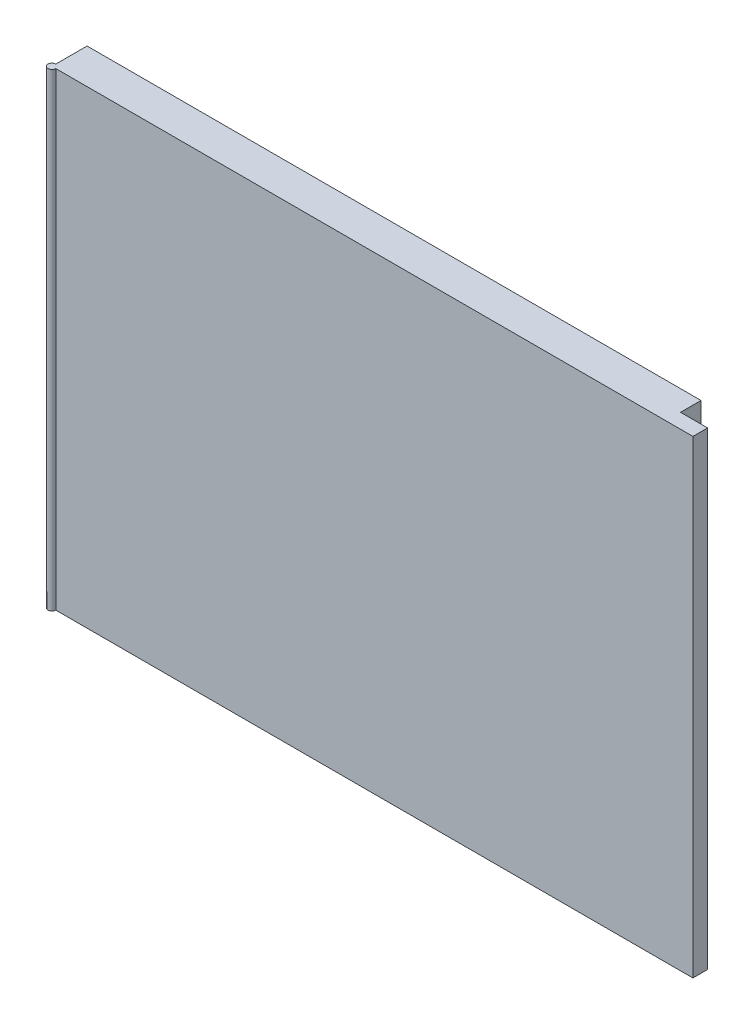
ISO-10303-21;
HEADER;
FILE_DESCRIPTION(('STEP AP214'),'2;1');
FILE_NAME('part.step','',(''),(''),'','','');
FILE_SCHEMA(('AUTOMOTIVE_DESIGN { 1 0 10303 214 1 1 1 1 }'));
ENDSEC;
DATA;
#1=APPLICATION_CONTEXT('core data for automotive mechanical design processes');
#2=APPLICATION_PROTOCOL_DEFINITION('international standard','automotive_design',2000,#1);
#3=PRODUCT_CONTEXT('',#1,'mechanical');
#4=PRODUCT('Part','Part','',(#3));
#5=PRODUCT_RELATED_PRODUCT_CATEGORY('part','',(#4));
#6=PRODUCT_DEFINITION_FORMATION('','',#4);
#7=PRODUCT_DEFINITION_CONTEXT('part definition',#1,'design');
#8=PRODUCT_DEFINITION('design','',#6,#7);
#9=PRODUCT_DEFINITION_SHAPE('','',#8);
#10=(LENGTH_UNIT() NAMED_UNIT(*) SI_UNIT(.MILLI.,.METRE.));
#11=(NAMED_UNIT(*) PLANE_ANGLE_UNIT() SI_UNIT($,.RADIAN.));
#12=(NAMED_UNIT(*) SI_UNIT($,.STERADIAN.) SOLID_ANGLE_UNIT());
#13=UNCERTAINTY_MEASURE_WITH_UNIT(LENGTH_MEASURE(1.E-05),#10,'distance_accuracy_value','');
#14=(GEOMETRIC_REPRESENTATION_CONTEXT(3) GLOBAL_UNCERTAINTY_ASSIGNED_CONTEXT((#13)) GLOBAL_UNIT_ASSIGNED_CONTEXT((#10,
#11,#12)) REPRESENTATION_CONTEXT('',''));
#15=CARTESIAN_POINT('',(0.,0.,0.));
#16=DIRECTION('',(0.,0.,1.));
#17=DIRECTION('',(1.,0.,0.));
#18=AXIS2_PLACEMENT_3D('',#15,#16,#17);
#19=CARTESIAN_POINT('',(0.,600.,0.));
#20=DIRECTION('',(0.,-1.,0.));
#21=DIRECTION('',(0.,0.,-1.));
#22=AXIS2_PLACEMENT_3D('',#19,#20,#21);
#23=CYLINDRICAL_SURFACE('',#22,5.);
#24=CARTESIAN_POINT('',(0.,0.,0.));
#25=DIRECTION('',(0.,1.,0.));
#26=DIRECTION('',(0.,0.,1.));
#27=AXIS2_PLACEMENT_3D('',#24,#25,#26);
#28=CIRCLE('',#27,5.);
#29=CARTESIAN_POINT('',(0.,0.,-5.));
#30=VERTEX_POINT('',#29);
#31=CARTESIAN_POINT('',(5.,0.,0.));
#32=VERTEX_POINT('',#31);
#33=EDGE_CURVE('E124',#30,#32,#28,.T.);
#34=ORIENTED_EDGE('',*,*,#33,.T.);
#35=DIRECTION('',(0.,-1.,0.));
#36=VECTOR('',#35,1.);
#37=CARTESIAN_POINT('',(5.,600.,0.));
#38=LINE('',#37,#36);
#39=CARTESIAN_POINT('',(5.,600.,0.));
#40=VERTEX_POINT('',#39);
#41=EDGE_CURVE('E11',#40,#32,#38,.T.);
#42=ORIENTED_EDGE('',*,*,#41,.F.);
#43=CARTESIAN_POINT('',(0.,600.,0.));
#44=DIRECTION('',(0.,1.,0.));
#45=DIRECTION('',(0.,0.,1.));
#46=AXIS2_PLACEMENT_3D('',#43,#44,#45);
#47=CIRCLE('',#46,5.);
#48=CARTESIAN_POINT('',(0.,600.,-5.));
#49=VERTEX_POINT('',#48);
#50=EDGE_CURVE('E136',#49,#40,#47,.T.);
#51=ORIENTED_EDGE('',*,*,#50,.F.);
#52=DIRECTION('',(0.,-1.,0.));
#53=VECTOR('',#52,1.);
#54=CARTESIAN_POINT('',(0.,600.,-5.));
#55=LINE('',#54,#53);
#56=EDGE_CURVE('E120',#49,#30,#55,.T.);
#57=ORIENTED_EDGE('',*,*,#56,.T.);
#58=EDGE_LOOP('',(#34,#42,#51,#57));
#59=FACE_BOUND('',#58,.T.);
#60=ADVANCED_FACE('F34',(#59),#23,.T.);
#61=CARTESIAN_POINT('',(5.,600.,0.));
#62=DIRECTION('',(0.,0.,-1.));
#63=DIRECTION('',(-1.,0.,0.));
#64=AXIS2_PLACEMENT_3D('',#61,#62,#63);
#65=PLANE('',#64);
#66=DIRECTION('',(1.,0.,0.));
#67=VECTOR('',#66,1.);
#68=CARTESIAN_POINT('',(5.,0.,0.));
#69=LINE('',#68,#67);
#70=CARTESIAN_POINT('',(820.,0.,0.));
#71=VERTEX_POINT('',#70);
#72=EDGE_CURVE('E127',#32,#71,#69,.T.);
#73=ORIENTED_EDGE('',*,*,#72,.T.);
#74=DIRECTION('',(0.,-1.,0.));
#75=VECTOR('',#74,1.);
#76=CARTESIAN_POINT('',(820.,600.,0.));
#77=LINE('',#76,#75);
#78=CARTESIAN_POINT('',(820.,600.,0.));
#79=VERTEX_POINT('',#78);
#80=EDGE_CURVE('E42',#79,#71,#77,.T.);
#81=ORIENTED_EDGE('',*,*,#80,.F.);
#82=DIRECTION('',(1.,0.,0.));
#83=VECTOR('',#82,1.);
#84=CARTESIAN_POINT('',(5.,600.,0.));
#85=LINE('',#84,#83);
#86=EDGE_CURVE('E90',#40,#79,#85,.T.);
#87=ORIENTED_EDGE('',*,*,#86,.F.);
#88=ORIENTED_EDGE('',*,*,#41,.T.);
#89=EDGE_LOOP('',(#73,#81,#87,#88));
#90=FACE_BOUND('',#89,.T.);
#91=ADVANCED_FACE('F161',(#90),#65,.F.);
#92=CARTESIAN_POINT('',(820.,600.,-18.8003860041404));
#93=DIRECTION('',(-1.,0.,0.));
#94=DIRECTION('',(0.,0.,1.));
#95=AXIS2_PLACEMENT_3D('',#92,#93,#94);
#96=PLANE('',#95);
#97=DIRECTION('',(0.,0.,-1.));
#98=VECTOR('',#97,1.);
#99=CARTESIAN_POINT('',(820.,0.,-18.8003860041404));
#100=LINE('',#99,#98);
#101=CARTESIAN_POINT('',(820.,0.,-18.8003860041404));
#102=VERTEX_POINT('',#101);
#103=EDGE_CURVE('E129',#71,#102,#100,.T.);
#104=ORIENTED_EDGE('',*,*,#103,.T.);
#105=DIRECTION('',(0.,-1.,0.));
#106=VECTOR('',#105,1.);
#107=CARTESIAN_POINT('',(820.,600.,-18.8003860041404));
#108=LINE('',#107,#106);
#109=CARTESIAN_POINT('',(820.,600.,-18.8003860041404));
#110=VERTEX_POINT('',#109);
#111=EDGE_CURVE('E140',#110,#102,#108,.T.);
#112=ORIENTED_EDGE('',*,*,#111,.F.);
#113=DIRECTION('',(0.,0.,-1.));
#114=VECTOR('',#113,1.);
#115=CARTESIAN_POINT('',(820.,600.,-18.8003860041404));
#116=LINE('',#115,#114);
#117=EDGE_CURVE('E148',#79,#110,#116,.T.);
#118=ORIENTED_EDGE('',*,*,#117,.F.);
#119=ORIENTED_EDGE('',*,*,#80,.T.);
#120=EDGE_LOOP('',(#104,#112,#118,#119));
#121=FACE_BOUND('',#120,.T.);
#122=ADVANCED_FACE('F146',(#121),#96,.F.);
#123=CARTESIAN_POINT('',(785.363179306368,600.,-18.8003860041404));
#124=DIRECTION('',(0.,0.,1.));
#125=DIRECTION('',(1.,0.,0.));
#126=AXIS2_PLACEMENT_3D('',#123,#124,#125);
#127=PLANE('',#126);
#128=DIRECTION('',(-1.,0.,0.));
#129=VECTOR('',#128,1.);
#130=CARTESIAN_POINT('',(785.363179306368,0.,-18.8003860041404));
#131=LINE('',#130,#129);
#132=CARTESIAN_POINT('',(785.363179306368,0.,-18.8003860041404));
#133=VERTEX_POINT('',#132);
#134=EDGE_CURVE('E131',#102,#133,#131,.T.);
#135=ORIENTED_EDGE('',*,*,#134,.T.);
#136=DIRECTION('',(0.,-1.,0.));
#137=VECTOR('',#136,1.);
#138=CARTESIAN_POINT('',(785.363179306368,600.,-18.8003860041404));
#139=LINE('',#138,#137);
#140=CARTESIAN_POINT('',(785.363179306368,600.,-18.8003860041404));
#141=VERTEX_POINT('',#140);
#142=EDGE_CURVE('E115',#141,#133,#139,.T.);
#143=ORIENTED_EDGE('',*,*,#142,.F.);
#144=DIRECTION('',(-1.,0.,0.));
#145=VECTOR('',#144,1.);
#146=CARTESIAN_POINT('',(785.363179306368,600.,-18.8003860041404));
#147=LINE('',#146,#145);
#148=EDGE_CURVE('E106',#110,#141,#147,.T.);
#149=ORIENTED_EDGE('',*,*,#148,.F.);
#150=ORIENTED_EDGE('',*,*,#111,.T.);
#151=EDGE_LOOP('',(#135,#143,#149,#150));
#152=FACE_BOUND('',#151,.T.);
#153=ADVANCED_FACE('F154',(#152),#127,.F.);
#154=CARTESIAN_POINT('',(785.363179306368,600.,-45.));
#155=DIRECTION('',(-1.,0.,0.));
#156=DIRECTION('',(0.,0.,1.));
#157=AXIS2_PLACEMENT_3D('',#154,#155,#156);
#158=PLANE('',#157);
#159=DIRECTION('',(0.,0.,-1.));
#160=VECTOR('',#159,1.);
#161=CARTESIAN_POINT('',(785.363179306368,0.,-45.));
#162=LINE('',#161,#160);
#163=CARTESIAN_POINT('',(785.363179306368,0.,-45.));
#164=VERTEX_POINT('',#163);
#165=EDGE_CURVE('E114',#133,#164,#162,.T.);
#166=ORIENTED_EDGE('',*,*,#165,.T.);
#167=DIRECTION('',(0.,-1.,0.));
#168=VECTOR('',#167,1.);
#169=CARTESIAN_POINT('',(785.363179306368,600.,-45.));
#170=LINE('',#169,#168);
#171=CARTESIAN_POINT('',(785.363179306368,600.,-45.));
#172=VERTEX_POINT('',#171);
#173=EDGE_CURVE('E111',#172,#164,#170,.T.);
#174=ORIENTED_EDGE('',*,*,#173,.F.);
#175=DIRECTION('',(0.,0.,-1.));
#176=VECTOR('',#175,1.);
#177=CARTESIAN_POINT('',(785.363179306368,600.,-45.));
#178=LINE('',#177,#176);
#179=EDGE_CURVE('E100',#141,#172,#178,.T.);
#180=ORIENTED_EDGE('',*,*,#179,.F.);
#181=ORIENTED_EDGE('',*,*,#142,.T.);
#182=EDGE_LOOP('',(#166,#174,#180,#181));
#183=FACE_BOUND('',#182,.T.);
#184=ADVANCED_FACE('F112',(#183),#158,.F.);
#185=CARTESIAN_POINT('',(0.,600.,-45.));
#186=DIRECTION('',(0.,0.,1.));
#187=DIRECTION('',(1.,0.,0.));
#188=AXIS2_PLACEMENT_3D('',#185,#186,#187);
#189=PLANE('',#188);
#190=DIRECTION('',(-1.,0.,0.));
#191=VECTOR('',#190,1.);
#192=CARTESIAN_POINT('',(0.,0.,-45.));
#193=LINE('',#192,#191);
#194=CARTESIAN_POINT('',(0.,0.,-45.));
#195=VERTEX_POINT('',#194);
#196=EDGE_CURVE('E76',#164,#195,#193,.T.);
#197=ORIENTED_EDGE('',*,*,#196,.T.);
#198=DIRECTION('',(0.,-1.,0.));
#199=VECTOR('',#198,1.);
#200=CARTESIAN_POINT('',(0.,600.,-45.));
#201=LINE('',#200,#199);
#202=CARTESIAN_POINT('',(0.,600.,-45.));
#203=VERTEX_POINT('',#202);
#204=EDGE_CURVE('E116',#203,#195,#201,.T.);
#205=ORIENTED_EDGE('',*,*,#204,.F.);
#206=DIRECTION('',(-1.,0.,0.));
#207=VECTOR('',#206,1.);
#208=CARTESIAN_POINT('',(0.,600.,-45.));
#209=LINE('',#208,#207);
#210=EDGE_CURVE('E104',#172,#203,#209,.T.);
#211=ORIENTED_EDGE('',*,*,#210,.F.);
#212=ORIENTED_EDGE('',*,*,#173,.T.);
#213=EDGE_LOOP('',(#197,#205,#211,#212));
#214=FACE_BOUND('',#213,.T.);
#215=ADVANCED_FACE('F118',(#214),#189,.F.);
#216=CARTESIAN_POINT('',(0.,600.,-5.));
#217=DIRECTION('',(1.,0.,0.));
#218=DIRECTION('',(0.,0.,-1.));
#219=AXIS2_PLACEMENT_3D('',#216,#217,#218);
#220=PLANE('',#219);
#221=DIRECTION('',(0.,0.,1.));
#222=VECTOR('',#221,1.);
#223=CARTESIAN_POINT('',(0.,0.,-5.));
#224=LINE('',#223,#222);
#225=EDGE_CURVE('E82',#195,#30,#224,.T.);
#226=ORIENTED_EDGE('',*,*,#225,.T.);
#227=ORIENTED_EDGE('',*,*,#56,.F.);
#228=DIRECTION('',(0.,0.,1.));
#229=VECTOR('',#228,1.);
#230=CARTESIAN_POINT('',(0.,600.,-5.));
#231=LINE('',#230,#229);
#232=EDGE_CURVE('E50',#203,#49,#231,.T.);
#233=ORIENTED_EDGE('',*,*,#232,.F.);
#234=ORIENTED_EDGE('',*,*,#204,.T.);
#235=EDGE_LOOP('',(#226,#227,#233,#234));
#236=FACE_BOUND('',#235,.T.);
#237=ADVANCED_FACE('F175',(#236),#220,.F.);
#238=CARTESIAN_POINT('',(0.,600.,0.));
#239=DIRECTION('',(0.,1.,0.));
#240=DIRECTION('',(0.,0.,1.));
#241=AXIS2_PLACEMENT_3D('',#238,#239,#240);
#242=PLANE('',#241);
#243=ORIENTED_EDGE('',*,*,#50,.T.);
#244=ORIENTED_EDGE('',*,*,#86,.T.);
#245=ORIENTED_EDGE('',*,*,#117,.T.);
#246=ORIENTED_EDGE('',*,*,#148,.T.);
#247=ORIENTED_EDGE('',*,*,#179,.T.);
#248=ORIENTED_EDGE('',*,*,#210,.T.);
#249=ORIENTED_EDGE('',*,*,#232,.T.);
#250=EDGE_LOOP('',(#243,#244,#245,#246,#247,#248,#249));
#251=FACE_BOUND('',#250,.T.);
#252=ADVANCED_FACE('F102',(#251),#242,.T.);
#253=CARTESIAN_POINT('',(0.,0.,0.));
#254=DIRECTION('',(0.,1.,0.));
#255=DIRECTION('',(0.,0.,1.));
#256=AXIS2_PLACEMENT_3D('',#253,#254,#255);
#257=PLANE('',#256);
#258=ORIENTED_EDGE('',*,*,#33,.F.);
#259=ORIENTED_EDGE('',*,*,#225,.F.);
#260=ORIENTED_EDGE('',*,*,#196,.F.);
#261=ORIENTED_EDGE('',*,*,#165,.F.);
#262=ORIENTED_EDGE('',*,*,#134,.F.);
#263=ORIENTED_EDGE('',*,*,#103,.F.);
#264=ORIENTED_EDGE('',*,*,#72,.F.);
#265=EDGE_LOOP('',(#258,#259,#260,#261,#262,#263,#264));
#266=FACE_BOUND('',#265,.T.);
#267=ADVANCED_FACE('F152',(#266),#257,.F.);
#268=CLOSED_SHELL('',(#60,#91,#122,#153,#184,#215,#237,#252,#267));
#269=MANIFOLD_SOLID_BREP('B2',#268);
#270=ADVANCED_BREP_SHAPE_REPRESENTATION('',(#18,#269),#14);
#271=SHAPE_DEFINITION_REPRESENTATION(#9,#270);
ENDSEC;
END-ISO-10303-21;
